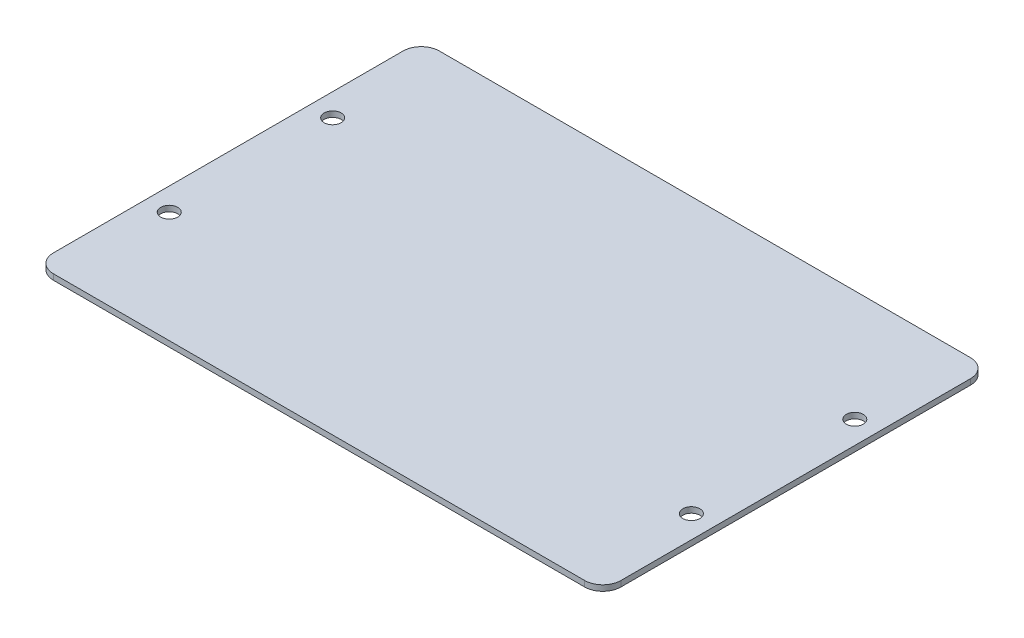
ISO-10303-21;
HEADER;
FILE_DESCRIPTION(('STEP AP214'),'2;1');
FILE_NAME('part.step','',(''),(''),'','','');
FILE_SCHEMA(('AUTOMOTIVE_DESIGN { 1 0 10303 214 1 1 1 1 }'));
ENDSEC;
DATA;
#1=APPLICATION_CONTEXT('core data for automotive mechanical design processes');
#2=APPLICATION_PROTOCOL_DEFINITION('international standard','automotive_design',2000,#1);
#3=PRODUCT_CONTEXT('',#1,'mechanical');
#4=PRODUCT('Part','Part','',(#3));
#5=PRODUCT_RELATED_PRODUCT_CATEGORY('part','',(#4));
#6=PRODUCT_DEFINITION_FORMATION('','',#4);
#7=PRODUCT_DEFINITION_CONTEXT('part definition',#1,'design');
#8=PRODUCT_DEFINITION('design','',#6,#7);
#9=PRODUCT_DEFINITION_SHAPE('','',#8);
#10=(LENGTH_UNIT() NAMED_UNIT(*) SI_UNIT(.MILLI.,.METRE.));
#11=(NAMED_UNIT(*) PLANE_ANGLE_UNIT() SI_UNIT($,.RADIAN.));
#12=(NAMED_UNIT(*) SI_UNIT($,.STERADIAN.) SOLID_ANGLE_UNIT());
#13=UNCERTAINTY_MEASURE_WITH_UNIT(LENGTH_MEASURE(1.E-05),#10,'distance_accuracy_value','');
#14=(GEOMETRIC_REPRESENTATION_CONTEXT(3) GLOBAL_UNCERTAINTY_ASSIGNED_CONTEXT((#13)) GLOBAL_UNIT_ASSIGNED_CONTEXT((#10,
#11,#12)) REPRESENTATION_CONTEXT('',''));
#15=CARTESIAN_POINT('',(0.,0.,0.));
#16=DIRECTION('',(0.,0.,1.));
#17=DIRECTION('',(1.,0.,0.));
#18=AXIS2_PLACEMENT_3D('',#15,#16,#17);
#19=CARTESIAN_POINT('',(0.,0.,0.));
#20=DIRECTION('',(0.,1.,0.));
#21=DIRECTION('',(0.,0.,1.));
#22=AXIS2_PLACEMENT_3D('',#19,#20,#21);
#23=PLANE('',#22);
#24=DIRECTION('',(0.,0.,1.));
#25=VECTOR('',#24,1.);
#26=CARTESIAN_POINT('',(-125.,0.,-85.));
#27=LINE('',#26,#25);
#28=CARTESIAN_POINT('',(-125.,0.,-77.));
#29=VERTEX_POINT('',#28);
#30=CARTESIAN_POINT('',(-125.,0.,77.));
#31=VERTEX_POINT('',#30);
#32=EDGE_CURVE('E171',#29,#31,#27,.T.);
#33=ORIENTED_EDGE('',*,*,#32,.F.);
#34=CARTESIAN_POINT('',(-117.,0.,-77.));
#35=DIRECTION('',(0.,1.,0.));
#36=DIRECTION('',(0.,0.,1.));
#37=AXIS2_PLACEMENT_3D('',#34,#35,#36);
#38=CIRCLE('',#37,8.);
#39=CARTESIAN_POINT('',(-117.,0.,-85.));
#40=VERTEX_POINT('',#39);
#41=EDGE_CURVE('E208',#29,#40,#38,.F.);
#42=ORIENTED_EDGE('',*,*,#41,.T.);
#43=DIRECTION('',(-1.,0.,0.));
#44=VECTOR('',#43,1.);
#45=CARTESIAN_POINT('',(-125.,0.,-85.));
#46=LINE('',#45,#44);
#47=CARTESIAN_POINT('',(117.,0.,-85.));
#48=VERTEX_POINT('',#47);
#49=EDGE_CURVE('E178',#48,#40,#46,.T.);
#50=ORIENTED_EDGE('',*,*,#49,.F.);
#51=CARTESIAN_POINT('',(117.,0.,-77.));
#52=DIRECTION('',(0.,1.,0.));
#53=DIRECTION('',(0.,0.,1.));
#54=AXIS2_PLACEMENT_3D('',#51,#52,#53);
#55=CIRCLE('',#54,8.);
#56=CARTESIAN_POINT('',(125.,0.,-77.));
#57=VERTEX_POINT('',#56);
#58=EDGE_CURVE('E206',#48,#57,#55,.F.);
#59=ORIENTED_EDGE('',*,*,#58,.T.);
#60=DIRECTION('',(0.,0.,-1.));
#61=VECTOR('',#60,1.);
#62=CARTESIAN_POINT('',(125.,0.,-85.));
#63=LINE('',#62,#61);
#64=CARTESIAN_POINT('',(125.,0.,77.));
#65=VERTEX_POINT('',#64);
#66=EDGE_CURVE('E193',#65,#57,#63,.T.);
#67=ORIENTED_EDGE('',*,*,#66,.F.);
#68=CARTESIAN_POINT('',(117.,0.,77.));
#69=DIRECTION('',(0.,1.,0.));
#70=DIRECTION('',(0.,0.,1.));
#71=AXIS2_PLACEMENT_3D('',#68,#69,#70);
#72=CIRCLE('',#71,8.);
#73=CARTESIAN_POINT('',(117.,0.,85.));
#74=VERTEX_POINT('',#73);
#75=EDGE_CURVE('E204',#65,#74,#72,.F.);
#76=ORIENTED_EDGE('',*,*,#75,.T.);
#77=DIRECTION('',(1.,0.,0.));
#78=VECTOR('',#77,1.);
#79=CARTESIAN_POINT('',(-125.,0.,85.));
#80=LINE('',#79,#78);
#81=CARTESIAN_POINT('',(-117.,0.,85.));
#82=VERTEX_POINT('',#81);
#83=EDGE_CURVE('E190',#82,#74,#80,.T.);
#84=ORIENTED_EDGE('',*,*,#83,.F.);
#85=CARTESIAN_POINT('',(-117.,0.,77.));
#86=DIRECTION('',(0.,1.,0.));
#87=DIRECTION('',(0.,0.,1.));
#88=AXIS2_PLACEMENT_3D('',#85,#86,#87);
#89=CIRCLE('',#88,8.);
#90=EDGE_CURVE('E202',#82,#31,#89,.F.);
#91=ORIENTED_EDGE('',*,*,#90,.T.);
#92=EDGE_LOOP('',(#33,#42,#50,#59,#67,#76,#84,#91));
#93=FACE_BOUND('',#92,.T.);
#94=CARTESIAN_POINT('',(-115.,0.,-36.));
#95=DIRECTION('',(0.,1.,0.));
#96=DIRECTION('',(0.,0.,1.));
#97=AXIS2_PLACEMENT_3D('',#94,#95,#96);
#98=CIRCLE('',#97,3.75000000000001);
#99=CARTESIAN_POINT('',(-115.,0.,-32.25));
#100=VERTEX_POINT('',#99);
#101=EDGE_CURVE('E168',#100,#100,#98,.T.);
#102=ORIENTED_EDGE('',*,*,#101,.T.);
#103=EDGE_LOOP('',(#102));
#104=FACE_BOUND('',#103,.T.);
#105=CARTESIAN_POINT('',(-115.,0.,36.));
#106=DIRECTION('',(0.,1.,0.));
#107=DIRECTION('',(0.,0.,-1.));
#108=AXIS2_PLACEMENT_3D('',#105,#106,#107);
#109=CIRCLE('',#108,3.75000000000001);
#110=CARTESIAN_POINT('',(-115.,0.,32.25));
#111=VERTEX_POINT('',#110);
#112=EDGE_CURVE('E153',#111,#111,#109,.T.);
#113=ORIENTED_EDGE('',*,*,#112,.T.);
#114=EDGE_LOOP('',(#113));
#115=FACE_BOUND('',#114,.T.);
#116=CARTESIAN_POINT('',(115.,0.,36.));
#117=DIRECTION('',(0.,1.,0.));
#118=DIRECTION('',(0.,0.,1.));
#119=AXIS2_PLACEMENT_3D('',#116,#117,#118);
#120=CIRCLE('',#119,3.75000000000001);
#121=CARTESIAN_POINT('',(115.,0.,39.75));
#122=VERTEX_POINT('',#121);
#123=EDGE_CURVE('E160',#122,#122,#120,.T.);
#124=ORIENTED_EDGE('',*,*,#123,.T.);
#125=EDGE_LOOP('',(#124));
#126=FACE_BOUND('',#125,.T.);
#127=CARTESIAN_POINT('',(115.,0.,-36.));
#128=DIRECTION('',(0.,1.,0.));
#129=DIRECTION('',(0.,0.,-1.));
#130=AXIS2_PLACEMENT_3D('',#127,#128,#129);
#131=CIRCLE('',#130,3.75000000000001);
#132=CARTESIAN_POINT('',(115.,0.,-39.75));
#133=VERTEX_POINT('',#132);
#134=EDGE_CURVE('E147',#133,#133,#131,.T.);
#135=ORIENTED_EDGE('',*,*,#134,.T.);
#136=EDGE_LOOP('',(#135));
#137=FACE_BOUND('',#136,.T.);
#138=DIRECTION('',(0.,0.,-1.));
#139=VECTOR('',#138,1.);
#140=CARTESIAN_POINT('',(-20.,0.,41.));
#141=LINE('',#140,#139);
#142=CARTESIAN_POINT('',(-20.,0.,41.));
#143=VERTEX_POINT('',#142);
#144=CARTESIAN_POINT('',(-20.,0.,-8.99999999999998));
#145=VERTEX_POINT('',#144);
#146=EDGE_CURVE('E143',#143,#145,#141,.T.);
#147=ORIENTED_EDGE('',*,*,#146,.F.);
#148=DIRECTION('',(-1.,0.,0.));
#149=VECTOR('',#148,1.);
#150=CARTESIAN_POINT('',(-20.,0.,41.));
#151=LINE('',#150,#149);
#152=CARTESIAN_POINT('',(20.,0.,41.));
#153=VERTEX_POINT('',#152);
#154=EDGE_CURVE('E140',#153,#143,#151,.T.);
#155=ORIENTED_EDGE('',*,*,#154,.F.);
#156=DIRECTION('',(0.,0.,1.));
#157=VECTOR('',#156,1.);
#158=CARTESIAN_POINT('',(20.,0.,41.));
#159=LINE('',#158,#157);
#160=CARTESIAN_POINT('',(20.,0.,-8.99999999999997));
#161=VERTEX_POINT('',#160);
#162=EDGE_CURVE('E55',#161,#153,#159,.T.);
#163=ORIENTED_EDGE('',*,*,#162,.F.);
#164=DIRECTION('',(1.,0.,0.));
#165=VECTOR('',#164,1.);
#166=CARTESIAN_POINT('',(-20.,0.,-8.99999999999998));
#167=LINE('',#166,#165);
#168=EDGE_CURVE('E50',#145,#161,#167,.T.);
#169=ORIENTED_EDGE('',*,*,#168,.F.);
#170=EDGE_LOOP('',(#147,#155,#163,#169));
#171=FACE_BOUND('',#170,.T.);
#172=ADVANCED_FACE('F35',(#93,#104,#115,#126,#137,#171),#23,.F.);
#173=CARTESIAN_POINT('',(-125.,2.5,-85.));
#174=DIRECTION('',(1.,0.,0.));
#175=DIRECTION('',(0.,0.,-1.));
#176=AXIS2_PLACEMENT_3D('',#173,#174,#175);
#177=PLANE('',#176);
#178=DIRECTION('',(0.,0.,1.));
#179=VECTOR('',#178,1.);
#180=CARTESIAN_POINT('',(-125.,2.5,-85.));
#181=LINE('',#180,#179);
#182=CARTESIAN_POINT('',(-125.,2.5,-77.));
#183=VERTEX_POINT('',#182);
#184=CARTESIAN_POINT('',(-125.,2.5,77.));
#185=VERTEX_POINT('',#184);
#186=EDGE_CURVE('E174',#183,#185,#181,.T.);
#187=ORIENTED_EDGE('',*,*,#186,.F.);
#188=DIRECTION('',(0.,-1.,0.));
#189=VECTOR('',#188,1.);
#190=CARTESIAN_POINT('',(-125.,2.5,-77.));
#191=LINE('',#190,#189);
#192=EDGE_CURVE('E199',#183,#29,#191,.T.);
#193=ORIENTED_EDGE('',*,*,#192,.T.);
#194=ORIENTED_EDGE('',*,*,#32,.T.);
#195=DIRECTION('',(0.,-1.,0.));
#196=VECTOR('',#195,1.);
#197=CARTESIAN_POINT('',(-125.,2.5,77.));
#198=LINE('',#197,#196);
#199=EDGE_CURVE('E187',#31,#185,#198,.F.);
#200=ORIENTED_EDGE('',*,*,#199,.T.);
#201=EDGE_LOOP('',(#187,#193,#194,#200));
#202=FACE_BOUND('',#201,.T.);
#203=ADVANCED_FACE('F265',(#202),#177,.F.);
#204=CARTESIAN_POINT('',(-125.,2.5,85.));
#205=DIRECTION('',(0.,0.,-1.));
#206=DIRECTION('',(-1.,0.,0.));
#207=AXIS2_PLACEMENT_3D('',#204,#205,#206);
#208=PLANE('',#207);
#209=ORIENTED_EDGE('',*,*,#83,.T.);
#210=DIRECTION('',(0.,-1.,0.));
#211=VECTOR('',#210,1.);
#212=CARTESIAN_POINT('',(117.,2.5,85.));
#213=LINE('',#212,#211);
#214=CARTESIAN_POINT('',(117.,2.5,85.));
#215=VERTEX_POINT('',#214);
#216=EDGE_CURVE('E11',#74,#215,#213,.F.);
#217=ORIENTED_EDGE('',*,*,#216,.T.);
#218=DIRECTION('',(1.,0.,0.));
#219=VECTOR('',#218,1.);
#220=CARTESIAN_POINT('',(-125.,2.5,85.));
#221=LINE('',#220,#219);
#222=CARTESIAN_POINT('',(-117.,2.5,85.));
#223=VERTEX_POINT('',#222);
#224=EDGE_CURVE('E177',#223,#215,#221,.T.);
#225=ORIENTED_EDGE('',*,*,#224,.F.);
#226=DIRECTION('',(0.,-1.,0.));
#227=VECTOR('',#226,1.);
#228=CARTESIAN_POINT('',(-117.,2.5,85.));
#229=LINE('',#228,#227);
#230=EDGE_CURVE('E43',#223,#82,#229,.T.);
#231=ORIENTED_EDGE('',*,*,#230,.T.);
#232=EDGE_LOOP('',(#209,#217,#225,#231));
#233=FACE_BOUND('',#232,.T.);
#234=ADVANCED_FACE('F232',(#233),#208,.F.);
#235=CARTESIAN_POINT('',(125.,2.5,-85.));
#236=DIRECTION('',(-1.,0.,0.));
#237=DIRECTION('',(0.,0.,1.));
#238=AXIS2_PLACEMENT_3D('',#235,#236,#237);
#239=PLANE('',#238);
#240=ORIENTED_EDGE('',*,*,#66,.T.);
#241=DIRECTION('',(0.,-1.,0.));
#242=VECTOR('',#241,1.);
#243=CARTESIAN_POINT('',(125.,2.5,-77.));
#244=LINE('',#243,#242);
#245=CARTESIAN_POINT('',(125.,2.5,-77.));
#246=VERTEX_POINT('',#245);
#247=EDGE_CURVE('E226',#57,#246,#244,.F.);
#248=ORIENTED_EDGE('',*,*,#247,.T.);
#249=DIRECTION('',(0.,0.,-1.));
#250=VECTOR('',#249,1.);
#251=CARTESIAN_POINT('',(125.,2.5,-85.));
#252=LINE('',#251,#250);
#253=CARTESIAN_POINT('',(125.,2.5,77.));
#254=VERTEX_POINT('',#253);
#255=EDGE_CURVE('E181',#254,#246,#252,.T.);
#256=ORIENTED_EDGE('',*,*,#255,.F.);
#257=DIRECTION('',(0.,-1.,0.));
#258=VECTOR('',#257,1.);
#259=CARTESIAN_POINT('',(125.,2.5,77.));
#260=LINE('',#259,#258);
#261=EDGE_CURVE('E223',#254,#65,#260,.T.);
#262=ORIENTED_EDGE('',*,*,#261,.T.);
#263=EDGE_LOOP('',(#240,#248,#256,#262));
#264=FACE_BOUND('',#263,.T.);
#265=ADVANCED_FACE('F246',(#264),#239,.F.);
#266=CARTESIAN_POINT('',(-125.,2.5,-85.));
#267=DIRECTION('',(0.,0.,1.));
#268=DIRECTION('',(1.,0.,0.));
#269=AXIS2_PLACEMENT_3D('',#266,#267,#268);
#270=PLANE('',#269);
#271=ORIENTED_EDGE('',*,*,#49,.T.);
#272=DIRECTION('',(0.,-1.,0.));
#273=VECTOR('',#272,1.);
#274=CARTESIAN_POINT('',(-117.,2.5,-85.));
#275=LINE('',#274,#273);
#276=CARTESIAN_POINT('',(-117.,2.5,-85.));
#277=VERTEX_POINT('',#276);
#278=EDGE_CURVE('E213',#40,#277,#275,.F.);
#279=ORIENTED_EDGE('',*,*,#278,.T.);
#280=DIRECTION('',(-1.,0.,0.));
#281=VECTOR('',#280,1.);
#282=CARTESIAN_POINT('',(-125.,2.5,-85.));
#283=LINE('',#282,#281);
#284=CARTESIAN_POINT('',(117.,2.5,-85.));
#285=VERTEX_POINT('',#284);
#286=EDGE_CURVE('E184',#285,#277,#283,.T.);
#287=ORIENTED_EDGE('',*,*,#286,.F.);
#288=DIRECTION('',(0.,-1.,0.));
#289=VECTOR('',#288,1.);
#290=CARTESIAN_POINT('',(117.,2.5,-85.));
#291=LINE('',#290,#289);
#292=EDGE_CURVE('E210',#285,#48,#291,.T.);
#293=ORIENTED_EDGE('',*,*,#292,.T.);
#294=EDGE_LOOP('',(#271,#279,#287,#293));
#295=FACE_BOUND('',#294,.T.);
#296=ADVANCED_FACE('F257',(#295),#270,.F.);
#297=CARTESIAN_POINT('',(0.,2.5,0.));
#298=DIRECTION('',(0.,1.,0.));
#299=DIRECTION('',(0.,0.,1.));
#300=AXIS2_PLACEMENT_3D('',#297,#298,#299);
#301=PLANE('',#300);
#302=CARTESIAN_POINT('',(115.,2.5,-36.));
#303=DIRECTION('',(0.,1.,0.));
#304=DIRECTION('',(0.,0.,-1.));
#305=AXIS2_PLACEMENT_3D('',#302,#303,#304);
#306=CIRCLE('',#305,3.75000000000001);
#307=CARTESIAN_POINT('',(115.,2.5,-39.75));
#308=VERTEX_POINT('',#307);
#309=EDGE_CURVE('E144',#308,#308,#306,.T.);
#310=ORIENTED_EDGE('',*,*,#309,.F.);
#311=EDGE_LOOP('',(#310));
#312=FACE_BOUND('',#311,.T.);
#313=CARTESIAN_POINT('',(115.,2.5,36.));
#314=DIRECTION('',(0.,1.,0.));
#315=DIRECTION('',(0.,0.,1.));
#316=AXIS2_PLACEMENT_3D('',#313,#314,#315);
#317=CIRCLE('',#316,3.75000000000001);
#318=CARTESIAN_POINT('',(115.,2.5,39.75));
#319=VERTEX_POINT('',#318);
#320=EDGE_CURVE('E163',#319,#319,#317,.T.);
#321=ORIENTED_EDGE('',*,*,#320,.F.);
#322=EDGE_LOOP('',(#321));
#323=FACE_BOUND('',#322,.T.);
#324=CARTESIAN_POINT('',(-115.,2.5,36.));
#325=DIRECTION('',(0.,1.,0.));
#326=DIRECTION('',(0.,0.,-1.));
#327=AXIS2_PLACEMENT_3D('',#324,#325,#326);
#328=CIRCLE('',#327,3.75000000000001);
#329=CARTESIAN_POINT('',(-115.,2.5,32.25));
#330=VERTEX_POINT('',#329);
#331=EDGE_CURVE('E157',#330,#330,#328,.T.);
#332=ORIENTED_EDGE('',*,*,#331,.F.);
#333=EDGE_LOOP('',(#332));
#334=FACE_BOUND('',#333,.T.);
#335=CARTESIAN_POINT('',(-115.,2.5,-36.));
#336=DIRECTION('',(0.,1.,0.));
#337=DIRECTION('',(0.,0.,1.));
#338=AXIS2_PLACEMENT_3D('',#335,#336,#337);
#339=CIRCLE('',#338,3.75000000000001);
#340=CARTESIAN_POINT('',(-115.,2.5,-32.25));
#341=VERTEX_POINT('',#340);
#342=EDGE_CURVE('E156',#341,#341,#339,.T.);
#343=ORIENTED_EDGE('',*,*,#342,.F.);
#344=EDGE_LOOP('',(#343));
#345=FACE_BOUND('',#344,.T.);
#346=ORIENTED_EDGE('',*,*,#286,.T.);
#347=CARTESIAN_POINT('',(-117.,2.5,-77.));
#348=DIRECTION('',(0.,1.,0.));
#349=DIRECTION('',(0.,0.,1.));
#350=AXIS2_PLACEMENT_3D('',#347,#348,#349);
#351=CIRCLE('',#350,8.);
#352=EDGE_CURVE('E221',#277,#183,#351,.T.);
#353=ORIENTED_EDGE('',*,*,#352,.T.);
#354=ORIENTED_EDGE('',*,*,#186,.T.);
#355=CARTESIAN_POINT('',(-117.,2.5,77.));
#356=DIRECTION('',(0.,1.,0.));
#357=DIRECTION('',(0.,0.,1.));
#358=AXIS2_PLACEMENT_3D('',#355,#356,#357);
#359=CIRCLE('',#358,8.);
#360=EDGE_CURVE('E215',#185,#223,#359,.T.);
#361=ORIENTED_EDGE('',*,*,#360,.T.);
#362=ORIENTED_EDGE('',*,*,#224,.T.);
#363=CARTESIAN_POINT('',(117.,2.5,77.));
#364=DIRECTION('',(0.,1.,0.));
#365=DIRECTION('',(0.,0.,1.));
#366=AXIS2_PLACEMENT_3D('',#363,#364,#365);
#367=CIRCLE('',#366,8.);
#368=EDGE_CURVE('E217',#215,#254,#367,.T.);
#369=ORIENTED_EDGE('',*,*,#368,.T.);
#370=ORIENTED_EDGE('',*,*,#255,.T.);
#371=CARTESIAN_POINT('',(117.,2.5,-77.));
#372=DIRECTION('',(0.,1.,0.));
#373=DIRECTION('',(0.,0.,1.));
#374=AXIS2_PLACEMENT_3D('',#371,#372,#373);
#375=CIRCLE('',#374,8.);
#376=EDGE_CURVE('E219',#246,#285,#375,.T.);
#377=ORIENTED_EDGE('',*,*,#376,.T.);
#378=EDGE_LOOP('',(#346,#353,#354,#361,#362,#369,#370,#377));
#379=FACE_BOUND('',#378,.T.);
#380=ADVANCED_FACE('F250',(#312,#323,#334,#345,#379),#301,.T.);
#381=CARTESIAN_POINT('',(-115.,0.,-36.));
#382=DIRECTION('',(0.,1.,0.));
#383=DIRECTION('',(0.,0.,1.));
#384=AXIS2_PLACEMENT_3D('',#381,#382,#383);
#385=CYLINDRICAL_SURFACE('',#384,3.75000000000001);
#386=ORIENTED_EDGE('',*,*,#101,.F.);
#387=EDGE_LOOP('',(#386));
#388=FACE_BOUND('',#387,.T.);
#389=ORIENTED_EDGE('',*,*,#342,.T.);
#390=EDGE_LOOP('',(#389));
#391=FACE_BOUND('',#390,.T.);
#392=ADVANCED_FACE('F360',(#388,#391),#385,.F.);
#393=CARTESIAN_POINT('',(-115.,0.,36.));
#394=DIRECTION('',(0.,1.,0.));
#395=DIRECTION('',(0.,0.,1.));
#396=AXIS2_PLACEMENT_3D('',#393,#394,#395);
#397=CYLINDRICAL_SURFACE('',#396,3.75000000000001);
#398=ORIENTED_EDGE('',*,*,#112,.F.);
#399=EDGE_LOOP('',(#398));
#400=FACE_BOUND('',#399,.T.);
#401=ORIENTED_EDGE('',*,*,#331,.T.);
#402=EDGE_LOOP('',(#401));
#403=FACE_BOUND('',#402,.T.);
#404=ADVANCED_FACE('F356',(#400,#403),#397,.F.);
#405=CARTESIAN_POINT('',(115.,0.,36.));
#406=DIRECTION('',(0.,1.,0.));
#407=DIRECTION('',(0.,0.,1.));
#408=AXIS2_PLACEMENT_3D('',#405,#406,#407);
#409=CYLINDRICAL_SURFACE('',#408,3.75000000000001);
#410=ORIENTED_EDGE('',*,*,#123,.F.);
#411=EDGE_LOOP('',(#410));
#412=FACE_BOUND('',#411,.T.);
#413=ORIENTED_EDGE('',*,*,#320,.T.);
#414=EDGE_LOOP('',(#413));
#415=FACE_BOUND('',#414,.T.);
#416=ADVANCED_FACE('F359',(#412,#415),#409,.F.);
#417=CARTESIAN_POINT('',(115.,0.,-36.));
#418=DIRECTION('',(0.,1.,0.));
#419=DIRECTION('',(0.,0.,1.));
#420=AXIS2_PLACEMENT_3D('',#417,#418,#419);
#421=CYLINDRICAL_SURFACE('',#420,3.75000000000001);
#422=ORIENTED_EDGE('',*,*,#134,.F.);
#423=EDGE_LOOP('',(#422));
#424=FACE_BOUND('',#423,.T.);
#425=ORIENTED_EDGE('',*,*,#309,.T.);
#426=EDGE_LOOP('',(#425));
#427=FACE_BOUND('',#426,.T.);
#428=ADVANCED_FACE('F290',(#424,#427),#421,.F.);
#429=CARTESIAN_POINT('',(-117.,2.5,-77.));
#430=DIRECTION('',(0.,-1.,0.));
#431=DIRECTION('',(0.,0.,-1.));
#432=AXIS2_PLACEMENT_3D('',#429,#430,#431);
#433=CYLINDRICAL_SURFACE('',#432,8.);
#434=ORIENTED_EDGE('',*,*,#352,.F.);
#435=ORIENTED_EDGE('',*,*,#278,.F.);
#436=ORIENTED_EDGE('',*,*,#41,.F.);
#437=ORIENTED_EDGE('',*,*,#192,.F.);
#438=EDGE_LOOP('',(#434,#435,#436,#437));
#439=FACE_BOUND('',#438,.T.);
#440=ADVANCED_FACE('F262',(#439),#433,.T.);
#441=CARTESIAN_POINT('',(117.,2.5,-77.));
#442=DIRECTION('',(0.,-1.,0.));
#443=DIRECTION('',(0.,0.,-1.));
#444=AXIS2_PLACEMENT_3D('',#441,#442,#443);
#445=CYLINDRICAL_SURFACE('',#444,8.);
#446=ORIENTED_EDGE('',*,*,#376,.F.);
#447=ORIENTED_EDGE('',*,*,#247,.F.);
#448=ORIENTED_EDGE('',*,*,#58,.F.);
#449=ORIENTED_EDGE('',*,*,#292,.F.);
#450=EDGE_LOOP('',(#446,#447,#448,#449));
#451=FACE_BOUND('',#450,.T.);
#452=ADVANCED_FACE('F254',(#451),#445,.T.);
#453=CARTESIAN_POINT('',(117.,2.5,77.));
#454=DIRECTION('',(0.,-1.,0.));
#455=DIRECTION('',(0.,0.,-1.));
#456=AXIS2_PLACEMENT_3D('',#453,#454,#455);
#457=CYLINDRICAL_SURFACE('',#456,8.);
#458=ORIENTED_EDGE('',*,*,#368,.F.);
#459=ORIENTED_EDGE('',*,*,#216,.F.);
#460=ORIENTED_EDGE('',*,*,#75,.F.);
#461=ORIENTED_EDGE('',*,*,#261,.F.);
#462=EDGE_LOOP('',(#458,#459,#460,#461));
#463=FACE_BOUND('',#462,.T.);
#464=ADVANCED_FACE('F243',(#463),#457,.T.);
#465=CARTESIAN_POINT('',(-117.,2.5,77.));
#466=DIRECTION('',(0.,-1.,0.));
#467=DIRECTION('',(0.,0.,-1.));
#468=AXIS2_PLACEMENT_3D('',#465,#466,#467);
#469=CYLINDRICAL_SURFACE('',#468,8.);
#470=ORIENTED_EDGE('',*,*,#360,.F.);
#471=ORIENTED_EDGE('',*,*,#199,.F.);
#472=ORIENTED_EDGE('',*,*,#90,.F.);
#473=ORIENTED_EDGE('',*,*,#230,.F.);
#474=EDGE_LOOP('',(#470,#471,#472,#473));
#475=FACE_BOUND('',#474,.T.);
#476=ADVANCED_FACE('F37',(#475),#469,.T.);
#477=CARTESIAN_POINT('',(-20.,-15.,41.));
#478=DIRECTION('',(1.,0.,0.));
#479=DIRECTION('',(0.,0.,-1.));
#480=AXIS2_PLACEMENT_3D('',#477,#478,#479);
#481=PLANE('',#480);
#482=ORIENTED_EDGE('',*,*,#146,.T.);
#483=DIRECTION('',(0.,1.,0.));
#484=VECTOR('',#483,1.);
#485=CARTESIAN_POINT('',(-20.,-15.,-8.99999999999998));
#486=LINE('',#485,#484);
#487=CARTESIAN_POINT('',(-20.,-15.,-8.99999999999998));
#488=VERTEX_POINT('',#487);
#489=EDGE_CURVE('E124',#488,#145,#486,.T.);
#490=ORIENTED_EDGE('',*,*,#489,.F.);
#491=DIRECTION('',(0.,0.,-1.));
#492=VECTOR('',#491,1.);
#493=CARTESIAN_POINT('',(-20.,-15.,41.));
#494=LINE('',#493,#492);
#495=CARTESIAN_POINT('',(-20.,-15.,41.));
#496=VERTEX_POINT('',#495);
#497=EDGE_CURVE('E131',#496,#488,#494,.T.);
#498=ORIENTED_EDGE('',*,*,#497,.F.);
#499=DIRECTION('',(0.,1.,0.));
#500=VECTOR('',#499,1.);
#501=CARTESIAN_POINT('',(-20.,-15.,41.));
#502=LINE('',#501,#500);
#503=EDGE_CURVE('E385',#496,#143,#502,.T.);
#504=ORIENTED_EDGE('',*,*,#503,.T.);
#505=EDGE_LOOP('',(#482,#490,#498,#504));
#506=FACE_BOUND('',#505,.T.);
#507=ADVANCED_FACE('F142',(#506),#481,.F.);
#508=CARTESIAN_POINT('',(-20.,-15.,-8.99999999999998));
#509=DIRECTION('',(0.,0.,1.));
#510=DIRECTION('',(1.,0.,0.));
#511=AXIS2_PLACEMENT_3D('',#508,#509,#510);
#512=PLANE('',#511);
#513=ORIENTED_EDGE('',*,*,#168,.T.);
#514=DIRECTION('',(0.,1.,0.));
#515=VECTOR('',#514,1.);
#516=CARTESIAN_POINT('',(20.,-15.,-8.99999999999997));
#517=LINE('',#516,#515);
#518=CARTESIAN_POINT('',(20.,-15.,-8.99999999999997));
#519=VERTEX_POINT('',#518);
#520=EDGE_CURVE('E127',#519,#161,#517,.T.);
#521=ORIENTED_EDGE('',*,*,#520,.F.);
#522=DIRECTION('',(1.,0.,0.));
#523=VECTOR('',#522,1.);
#524=CARTESIAN_POINT('',(-20.,-15.,-8.99999999999998));
#525=LINE('',#524,#523);
#526=EDGE_CURVE('E120',#488,#519,#525,.T.);
#527=ORIENTED_EDGE('',*,*,#526,.F.);
#528=ORIENTED_EDGE('',*,*,#489,.T.);
#529=EDGE_LOOP('',(#513,#521,#527,#528));
#530=FACE_BOUND('',#529,.T.);
#531=ADVANCED_FACE('F122',(#530),#512,.F.);
#532=CARTESIAN_POINT('',(20.,-15.,41.));
#533=DIRECTION('',(-1.,0.,0.));
#534=DIRECTION('',(0.,0.,1.));
#535=AXIS2_PLACEMENT_3D('',#532,#533,#534);
#536=PLANE('',#535);
#537=ORIENTED_EDGE('',*,*,#162,.T.);
#538=DIRECTION('',(0.,1.,0.));
#539=VECTOR('',#538,1.);
#540=CARTESIAN_POINT('',(20.,-15.,41.));
#541=LINE('',#540,#539);
#542=CARTESIAN_POINT('',(20.,-15.,41.));
#543=VERTEX_POINT('',#542);
#544=EDGE_CURVE('E149',#543,#153,#541,.T.);
#545=ORIENTED_EDGE('',*,*,#544,.F.);
#546=DIRECTION('',(0.,0.,1.));
#547=VECTOR('',#546,1.);
#548=CARTESIAN_POINT('',(20.,-15.,41.));
#549=LINE('',#548,#547);
#550=EDGE_CURVE('E130',#519,#543,#549,.T.);
#551=ORIENTED_EDGE('',*,*,#550,.F.);
#552=ORIENTED_EDGE('',*,*,#520,.T.);
#553=EDGE_LOOP('',(#537,#545,#551,#552));
#554=FACE_BOUND('',#553,.T.);
#555=ADVANCED_FACE('F324',(#554),#536,.F.);
#556=CARTESIAN_POINT('',(-20.,-15.,41.));
#557=DIRECTION('',(0.,0.,-1.));
#558=DIRECTION('',(-1.,0.,0.));
#559=AXIS2_PLACEMENT_3D('',#556,#557,#558);
#560=PLANE('',#559);
#561=ORIENTED_EDGE('',*,*,#154,.T.);
#562=ORIENTED_EDGE('',*,*,#503,.F.);
#563=DIRECTION('',(-1.,0.,0.));
#564=VECTOR('',#563,1.);
#565=CARTESIAN_POINT('',(-20.,-15.,41.));
#566=LINE('',#565,#564);
#567=EDGE_CURVE('E136',#543,#496,#566,.T.);
#568=ORIENTED_EDGE('',*,*,#567,.F.);
#569=ORIENTED_EDGE('',*,*,#544,.T.);
#570=EDGE_LOOP('',(#561,#562,#568,#569));
#571=FACE_BOUND('',#570,.T.);
#572=ADVANCED_FACE('F333',(#571),#560,.F.);
#573=CARTESIAN_POINT('',(0.,-15.,0.));
#574=DIRECTION('',(0.,-1.,0.));
#575=DIRECTION('',(0.,0.,-1.));
#576=AXIS2_PLACEMENT_3D('',#573,#574,#575);
#577=PLANE('',#576);
#578=ORIENTED_EDGE('',*,*,#497,.T.);
#579=ORIENTED_EDGE('',*,*,#526,.T.);
#580=ORIENTED_EDGE('',*,*,#550,.T.);
#581=ORIENTED_EDGE('',*,*,#567,.T.);
#582=EDGE_LOOP('',(#578,#579,#580,#581));
#583=FACE_BOUND('',#582,.T.);
#584=ADVANCED_FACE('F134',(#583),#577,.T.);
#585=CLOSED_SHELL('',(#172,#203,#234,#265,#296,#380,#392,#404,#416,#428,#440,#452,#464,#476,
#507,#531,#555,#572,#584));
#586=MANIFOLD_SOLID_BREP('B2',#585);
#587=ADVANCED_BREP_SHAPE_REPRESENTATION('',(#18,#586),#14);
#588=SHAPE_DEFINITION_REPRESENTATION(#9,#587);
ENDSEC;
END-ISO-10303-21;
